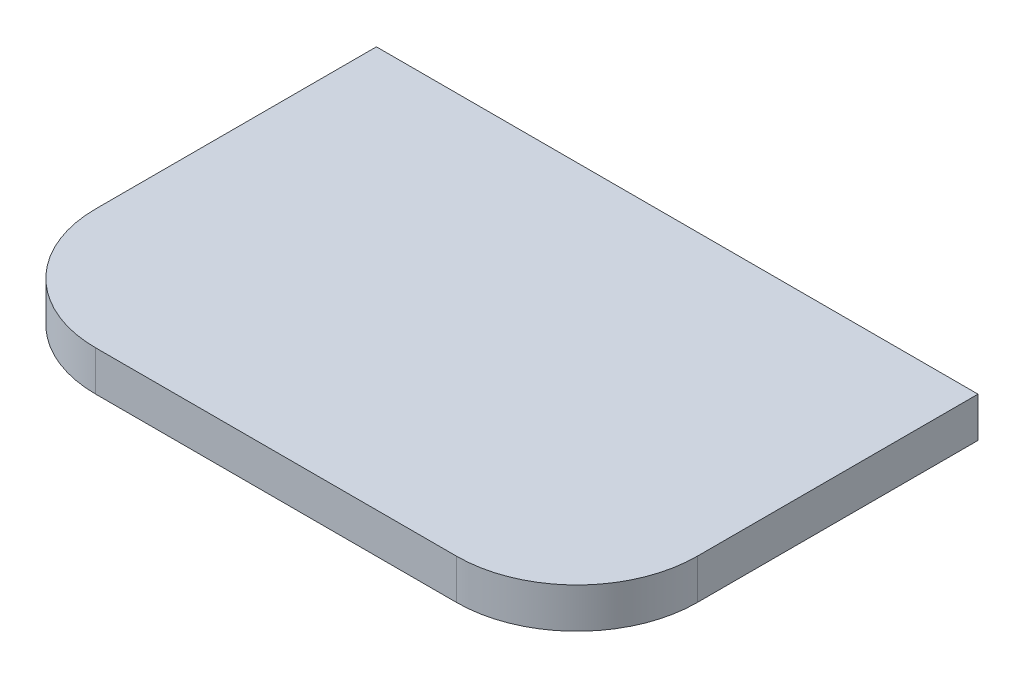
ISO-10303-21;
HEADER;
FILE_DESCRIPTION(('STEP AP214'),'2;1');
FILE_NAME('part.step','',(''),(''),'','','');
FILE_SCHEMA(('AUTOMOTIVE_DESIGN { 1 0 10303 214 1 1 1 1 }'));
ENDSEC;
DATA;
#1=APPLICATION_CONTEXT('core data for automotive mechanical design processes');
#2=APPLICATION_PROTOCOL_DEFINITION('international standard','automotive_design',2000,#1);
#3=PRODUCT_CONTEXT('',#1,'mechanical');
#4=PRODUCT('Part','Part','',(#3));
#5=PRODUCT_RELATED_PRODUCT_CATEGORY('part','',(#4));
#6=PRODUCT_DEFINITION_FORMATION('','',#4);
#7=PRODUCT_DEFINITION_CONTEXT('part definition',#1,'design');
#8=PRODUCT_DEFINITION('design','',#6,#7);
#9=PRODUCT_DEFINITION_SHAPE('','',#8);
#10=(LENGTH_UNIT() NAMED_UNIT(*) SI_UNIT(.MILLI.,.METRE.));
#11=(NAMED_UNIT(*) PLANE_ANGLE_UNIT() SI_UNIT($,.RADIAN.));
#12=(NAMED_UNIT(*) SI_UNIT($,.STERADIAN.) SOLID_ANGLE_UNIT());
#13=UNCERTAINTY_MEASURE_WITH_UNIT(LENGTH_MEASURE(1.E-05),#10,'distance_accuracy_value','');
#14=(GEOMETRIC_REPRESENTATION_CONTEXT(3) GLOBAL_UNCERTAINTY_ASSIGNED_CONTEXT((#13)) GLOBAL_UNIT_ASSIGNED_CONTEXT((#10,
#11,#12)) REPRESENTATION_CONTEXT('',''));
#15=CARTESIAN_POINT('',(0.,0.,0.));
#16=DIRECTION('',(0.,0.,1.));
#17=DIRECTION('',(1.,0.,0.));
#18=AXIS2_PLACEMENT_3D('',#15,#16,#17);
#19=CARTESIAN_POINT('',(45.,10.,-30.));
#20=DIRECTION('',(0.,-1.,0.));
#21=DIRECTION('',(0.,0.,-1.));
#22=AXIS2_PLACEMENT_3D('',#19,#20,#21);
#23=CYLINDRICAL_SURFACE('',#22,30.);
#24=CARTESIAN_POINT('',(45.,0.,-30.));
#25=DIRECTION('',(0.,1.,0.));
#26=DIRECTION('',(0.,0.,1.));
#27=AXIS2_PLACEMENT_3D('',#24,#25,#26);
#28=CIRCLE('',#27,30.);
#29=CARTESIAN_POINT('',(44.9999999999998,0.,0.));
#30=VERTEX_POINT('',#29);
#31=CARTESIAN_POINT('',(75.,0.,-30.0000000000002));
#32=VERTEX_POINT('',#31);
#33=EDGE_CURVE('E134',#30,#32,#28,.T.);
#34=ORIENTED_EDGE('',*,*,#33,.T.);
#35=DIRECTION('',(0.,-1.,0.));
#36=VECTOR('',#35,1.);
#37=CARTESIAN_POINT('',(75.,10.,-30.0000000000002));
#38=LINE('',#37,#36);
#39=CARTESIAN_POINT('',(75.,10.,-30.0000000000002));
#40=VERTEX_POINT('',#39);
#41=EDGE_CURVE('E11',#40,#32,#38,.T.);
#42=ORIENTED_EDGE('',*,*,#41,.F.);
#43=CARTESIAN_POINT('',(45.,10.,-30.));
#44=DIRECTION('',(0.,1.,0.));
#45=DIRECTION('',(0.,0.,1.));
#46=AXIS2_PLACEMENT_3D('',#43,#44,#45);
#47=CIRCLE('',#46,30.);
#48=CARTESIAN_POINT('',(44.9999999999998,10.,0.));
#49=VERTEX_POINT('',#48);
#50=EDGE_CURVE('E150',#49,#40,#47,.T.);
#51=ORIENTED_EDGE('',*,*,#50,.F.);
#52=DIRECTION('',(0.,-1.,0.));
#53=VECTOR('',#52,1.);
#54=CARTESIAN_POINT('',(44.9999999999998,10.,0.));
#55=LINE('',#54,#53);
#56=EDGE_CURVE('E130',#49,#30,#55,.T.);
#57=ORIENTED_EDGE('',*,*,#56,.T.);
#58=EDGE_LOOP('',(#34,#42,#51,#57));
#59=FACE_BOUND('',#58,.T.);
#60=ADVANCED_FACE('F45',(#59),#23,.T.);
#61=CARTESIAN_POINT('',(75.,10.,-30.0000000000002));
#62=DIRECTION('',(-1.,0.,0.));
#63=DIRECTION('',(0.,0.,1.));
#64=AXIS2_PLACEMENT_3D('',#61,#62,#63);
#65=PLANE('',#64);
#66=DIRECTION('',(0.,0.,-1.));
#67=VECTOR('',#66,1.);
#68=CARTESIAN_POINT('',(75.,0.,-30.0000000000002));
#69=LINE('',#68,#67);
#70=CARTESIAN_POINT('',(75.,0.,-100.));
#71=VERTEX_POINT('',#70);
#72=EDGE_CURVE('E138',#32,#71,#69,.T.);
#73=ORIENTED_EDGE('',*,*,#72,.T.);
#74=DIRECTION('',(0.,-1.,0.));
#75=VECTOR('',#74,1.);
#76=CARTESIAN_POINT('',(75.,10.,-100.));
#77=LINE('',#76,#75);
#78=CARTESIAN_POINT('',(75.,10.,-100.));
#79=VERTEX_POINT('',#78);
#80=EDGE_CURVE('E54',#79,#71,#77,.T.);
#81=ORIENTED_EDGE('',*,*,#80,.F.);
#82=DIRECTION('',(0.,0.,-1.));
#83=VECTOR('',#82,1.);
#84=CARTESIAN_POINT('',(75.,10.,-30.0000000000002));
#85=LINE('',#84,#83);
#86=EDGE_CURVE('E99',#40,#79,#85,.T.);
#87=ORIENTED_EDGE('',*,*,#86,.F.);
#88=ORIENTED_EDGE('',*,*,#41,.T.);
#89=EDGE_LOOP('',(#73,#81,#87,#88));
#90=FACE_BOUND('',#89,.T.);
#91=ADVANCED_FACE('F178',(#90),#65,.F.);
#92=CARTESIAN_POINT('',(-75.,10.,-100.));
#93=DIRECTION('',(0.,0.,1.));
#94=DIRECTION('',(1.,0.,0.));
#95=AXIS2_PLACEMENT_3D('',#92,#93,#94);
#96=PLANE('',#95);
#97=DIRECTION('',(-1.,0.,0.));
#98=VECTOR('',#97,1.);
#99=CARTESIAN_POINT('',(-75.,0.,-100.));
#100=LINE('',#99,#98);
#101=CARTESIAN_POINT('',(-75.,0.,-100.));
#102=VERTEX_POINT('',#101);
#103=EDGE_CURVE('E141',#71,#102,#100,.T.);
#104=ORIENTED_EDGE('',*,*,#103,.T.);
#105=DIRECTION('',(0.,-1.,0.));
#106=VECTOR('',#105,1.);
#107=CARTESIAN_POINT('',(-75.,10.,-100.));
#108=LINE('',#107,#106);
#109=CARTESIAN_POINT('',(-75.,10.,-100.));
#110=VERTEX_POINT('',#109);
#111=EDGE_CURVE('E123',#110,#102,#108,.T.);
#112=ORIENTED_EDGE('',*,*,#111,.F.);
#113=DIRECTION('',(-1.,0.,0.));
#114=VECTOR('',#113,1.);
#115=CARTESIAN_POINT('',(-75.,10.,-100.));
#116=LINE('',#115,#114);
#117=EDGE_CURVE('E112',#79,#110,#116,.T.);
#118=ORIENTED_EDGE('',*,*,#117,.F.);
#119=ORIENTED_EDGE('',*,*,#80,.T.);
#120=EDGE_LOOP('',(#104,#112,#118,#119));
#121=FACE_BOUND('',#120,.T.);
#122=ADVANCED_FACE('F160',(#121),#96,.F.);
#123=CARTESIAN_POINT('',(-75.,10.,-30.0000000000002));
#124=DIRECTION('',(1.,0.,0.));
#125=DIRECTION('',(0.,0.,-1.));
#126=AXIS2_PLACEMENT_3D('',#123,#124,#125);
#127=PLANE('',#126);
#128=DIRECTION('',(0.,0.,1.));
#129=VECTOR('',#128,1.);
#130=CARTESIAN_POINT('',(-75.,0.,-30.0000000000002));
#131=LINE('',#130,#129);
#132=CARTESIAN_POINT('',(-75.,0.,-30.0000000000002));
#133=VERTEX_POINT('',#132);
#134=EDGE_CURVE('E121',#102,#133,#131,.T.);
#135=ORIENTED_EDGE('',*,*,#134,.T.);
#136=DIRECTION('',(0.,-1.,0.));
#137=VECTOR('',#136,1.);
#138=CARTESIAN_POINT('',(-75.,10.,-30.0000000000002));
#139=LINE('',#138,#137);
#140=CARTESIAN_POINT('',(-75.,10.,-30.0000000000002));
#141=VERTEX_POINT('',#140);
#142=EDGE_CURVE('E118',#141,#133,#139,.T.);
#143=ORIENTED_EDGE('',*,*,#142,.F.);
#144=DIRECTION('',(0.,0.,1.));
#145=VECTOR('',#144,1.);
#146=CARTESIAN_POINT('',(-75.,10.,-30.0000000000002));
#147=LINE('',#146,#145);
#148=EDGE_CURVE('E106',#110,#141,#147,.T.);
#149=ORIENTED_EDGE('',*,*,#148,.F.);
#150=ORIENTED_EDGE('',*,*,#111,.T.);
#151=EDGE_LOOP('',(#135,#143,#149,#150));
#152=FACE_BOUND('',#151,.T.);
#153=ADVANCED_FACE('F119',(#152),#127,.F.);
#154=CARTESIAN_POINT('',(-45.,10.,-30.));
#155=DIRECTION('',(0.,-1.,0.));
#156=DIRECTION('',(0.,0.,-1.));
#157=AXIS2_PLACEMENT_3D('',#154,#155,#156);
#158=CYLINDRICAL_SURFACE('',#157,30.);
#159=CARTESIAN_POINT('',(-45.,0.,-30.));
#160=DIRECTION('',(0.,1.,0.));
#161=DIRECTION('',(0.,0.,-1.));
#162=AXIS2_PLACEMENT_3D('',#159,#160,#161);
#163=CIRCLE('',#162,30.);
#164=CARTESIAN_POINT('',(-44.9999999999998,0.,0.));
#165=VERTEX_POINT('',#164);
#166=EDGE_CURVE('E85',#133,#165,#163,.T.);
#167=ORIENTED_EDGE('',*,*,#166,.T.);
#168=DIRECTION('',(0.,-1.,0.));
#169=VECTOR('',#168,1.);
#170=CARTESIAN_POINT('',(-44.9999999999998,10.,0.));
#171=LINE('',#170,#169);
#172=CARTESIAN_POINT('',(-44.9999999999998,10.,0.));
#173=VERTEX_POINT('',#172);
#174=EDGE_CURVE('E124',#173,#165,#171,.T.);
#175=ORIENTED_EDGE('',*,*,#174,.F.);
#176=CARTESIAN_POINT('',(-45.,10.,-30.));
#177=DIRECTION('',(0.,1.,0.));
#178=DIRECTION('',(0.,0.,-1.));
#179=AXIS2_PLACEMENT_3D('',#176,#177,#178);
#180=CIRCLE('',#179,30.);
#181=EDGE_CURVE('E110',#141,#173,#180,.T.);
#182=ORIENTED_EDGE('',*,*,#181,.F.);
#183=ORIENTED_EDGE('',*,*,#142,.T.);
#184=EDGE_LOOP('',(#167,#175,#182,#183));
#185=FACE_BOUND('',#184,.T.);
#186=ADVANCED_FACE('F126',(#185),#158,.T.);
#187=CARTESIAN_POINT('',(-44.9999999999998,10.,0.));
#188=DIRECTION('',(0.,0.,-1.));
#189=DIRECTION('',(-1.,0.,0.));
#190=AXIS2_PLACEMENT_3D('',#187,#188,#189);
#191=PLANE('',#190);
#192=DIRECTION('',(1.,0.,0.));
#193=VECTOR('',#192,1.);
#194=CARTESIAN_POINT('',(-44.9999999999998,0.,0.));
#195=LINE('',#194,#193);
#196=EDGE_CURVE('E91',#165,#30,#195,.T.);
#197=ORIENTED_EDGE('',*,*,#196,.T.);
#198=ORIENTED_EDGE('',*,*,#56,.F.);
#199=DIRECTION('',(1.,0.,0.));
#200=VECTOR('',#199,1.);
#201=CARTESIAN_POINT('',(-44.9999999999998,10.,0.));
#202=LINE('',#201,#200);
#203=EDGE_CURVE('E62',#173,#49,#202,.T.);
#204=ORIENTED_EDGE('',*,*,#203,.F.);
#205=ORIENTED_EDGE('',*,*,#174,.T.);
#206=EDGE_LOOP('',(#197,#198,#204,#205));
#207=FACE_BOUND('',#206,.T.);
#208=ADVANCED_FACE('F167',(#207),#191,.F.);
#209=CARTESIAN_POINT('',(45.,10.,-30.));
#210=DIRECTION('',(0.,1.,0.));
#211=DIRECTION('',(0.,0.,1.));
#212=AXIS2_PLACEMENT_3D('',#209,#210,#211);
#213=PLANE('',#212);
#214=ORIENTED_EDGE('',*,*,#50,.T.);
#215=ORIENTED_EDGE('',*,*,#86,.T.);
#216=ORIENTED_EDGE('',*,*,#117,.T.);
#217=ORIENTED_EDGE('',*,*,#148,.T.);
#218=ORIENTED_EDGE('',*,*,#181,.T.);
#219=ORIENTED_EDGE('',*,*,#203,.T.);
#220=EDGE_LOOP('',(#214,#215,#216,#217,#218,#219));
#221=FACE_BOUND('',#220,.T.);
#222=ADVANCED_FACE('F108',(#221),#213,.T.);
#223=CARTESIAN_POINT('',(45.,0.,-30.));
#224=DIRECTION('',(0.,1.,0.));
#225=DIRECTION('',(0.,0.,1.));
#226=AXIS2_PLACEMENT_3D('',#223,#224,#225);
#227=PLANE('',#226);
#228=ORIENTED_EDGE('',*,*,#33,.F.);
#229=ORIENTED_EDGE('',*,*,#196,.F.);
#230=ORIENTED_EDGE('',*,*,#166,.F.);
#231=ORIENTED_EDGE('',*,*,#134,.F.);
#232=ORIENTED_EDGE('',*,*,#103,.F.);
#233=ORIENTED_EDGE('',*,*,#72,.F.);
#234=EDGE_LOOP('',(#228,#229,#230,#231,#232,#233));
#235=FACE_BOUND('',#234,.T.);
#236=ADVANCED_FACE('F163',(#235),#227,.F.);
#237=CLOSED_SHELL('',(#60,#91,#122,#153,#186,#208,#222,#236));
#238=MANIFOLD_SOLID_BREP('B2',#237);
#239=ADVANCED_BREP_SHAPE_REPRESENTATION('',(#18,#238),#14);
#240=SHAPE_DEFINITION_REPRESENTATION(#9,#239);
ENDSEC;
END-ISO-10303-21;
